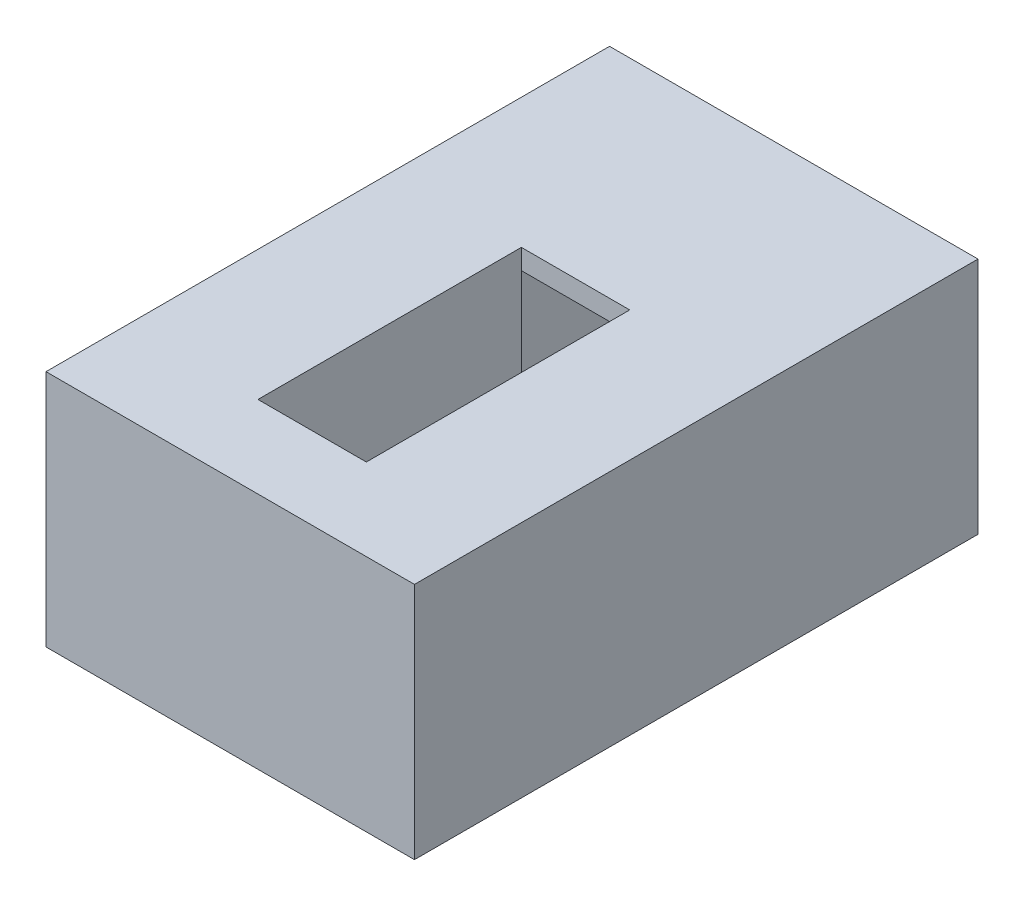
ISO-10303-21;
HEADER;
FILE_DESCRIPTION(('STEP AP214'),'2;1');
FILE_NAME('part.step','',(''),(''),'','','');
FILE_SCHEMA(('AUTOMOTIVE_DESIGN { 1 0 10303 214 1 1 1 1 }'));
ENDSEC;
DATA;
#1=APPLICATION_CONTEXT('core data for automotive mechanical design processes');
#2=APPLICATION_PROTOCOL_DEFINITION('international standard','automotive_design',2000,#1);
#3=PRODUCT_CONTEXT('',#1,'mechanical');
#4=PRODUCT('Part','Part','',(#3));
#5=PRODUCT_RELATED_PRODUCT_CATEGORY('part','',(#4));
#6=PRODUCT_DEFINITION_FORMATION('','',#4);
#7=PRODUCT_DEFINITION_CONTEXT('part definition',#1,'design');
#8=PRODUCT_DEFINITION('design','',#6,#7);
#9=PRODUCT_DEFINITION_SHAPE('','',#8);
#10=(LENGTH_UNIT() NAMED_UNIT(*) SI_UNIT(.MILLI.,.METRE.));
#11=(NAMED_UNIT(*) PLANE_ANGLE_UNIT() SI_UNIT($,.RADIAN.));
#12=(NAMED_UNIT(*) SI_UNIT($,.STERADIAN.) SOLID_ANGLE_UNIT());
#13=UNCERTAINTY_MEASURE_WITH_UNIT(LENGTH_MEASURE(1.E-05),#10,'distance_accuracy_value','');
#14=(GEOMETRIC_REPRESENTATION_CONTEXT(3) GLOBAL_UNCERTAINTY_ASSIGNED_CONTEXT((#13)) GLOBAL_UNIT_ASSIGNED_CONTEXT((#10,
#11,#12)) REPRESENTATION_CONTEXT('',''));
#15=CARTESIAN_POINT('',(0.,0.,0.));
#16=DIRECTION('',(0.,0.,1.));
#17=DIRECTION('',(1.,0.,0.));
#18=AXIS2_PLACEMENT_3D('',#15,#16,#17);
#19=CARTESIAN_POINT('',(1700.,1100.,2600.));
#20=DIRECTION('',(0.,-1.,0.));
#21=DIRECTION('',(0.,0.,-1.));
#22=AXIS2_PLACEMENT_3D('',#19,#20,#21);
#23=PLANE('',#22);
#24=DIRECTION('',(0.,0.,1.));
#25=VECTOR('',#24,1.);
#26=CARTESIAN_POINT('',(-1700.,1100.,2600.));
#27=LINE('',#26,#25);
#28=CARTESIAN_POINT('',(-1700.,1100.,-2600.));
#29=VERTEX_POINT('',#28);
#30=CARTESIAN_POINT('',(-1700.,1100.,2600.));
#31=VERTEX_POINT('',#30);
#32=EDGE_CURVE('E260',#29,#31,#27,.T.);
#33=ORIENTED_EDGE('',*,*,#32,.T.);
#34=DIRECTION('',(-1.,0.,0.));
#35=VECTOR('',#34,1.);
#36=CARTESIAN_POINT('',(1700.,1100.,2600.));
#37=LINE('',#36,#35);
#38=CARTESIAN_POINT('',(1700.,1100.,2600.));
#39=VERTEX_POINT('',#38);
#40=EDGE_CURVE('E268',#39,#31,#37,.T.);
#41=ORIENTED_EDGE('',*,*,#40,.F.);
#42=DIRECTION('',(0.,0.,1.));
#43=VECTOR('',#42,1.);
#44=CARTESIAN_POINT('',(1700.,1100.,2600.));
#45=LINE('',#44,#43);
#46=CARTESIAN_POINT('',(1700.,1100.,-2600.));
#47=VERTEX_POINT('',#46);
#48=EDGE_CURVE('E89',#47,#39,#45,.T.);
#49=ORIENTED_EDGE('',*,*,#48,.F.);
#50=DIRECTION('',(-1.,0.,0.));
#51=VECTOR('',#50,1.);
#52=CARTESIAN_POINT('',(1700.,1100.,-2600.));
#53=LINE('',#52,#51);
#54=EDGE_CURVE('E44',#47,#29,#53,.T.);
#55=ORIENTED_EDGE('',*,*,#54,.T.);
#56=EDGE_LOOP('',(#33,#41,#49,#55));
#57=FACE_BOUND('',#56,.T.);
#58=DIRECTION('',(0.,0.,1.));
#59=VECTOR('',#58,1.);
#60=CARTESIAN_POINT('',(-500.,1100.,1844.13253720411));
#61=LINE('',#60,#59);
#62=CARTESIAN_POINT('',(-500.,1100.,-586.486557773201));
#63=VERTEX_POINT('',#62);
#64=CARTESIAN_POINT('',(-500.,1100.,1844.13253720411));
#65=VERTEX_POINT('',#64);
#66=EDGE_CURVE('E208',#63,#65,#61,.T.);
#67=ORIENTED_EDGE('',*,*,#66,.F.);
#68=DIRECTION('',(1.,0.,0.));
#69=VECTOR('',#68,1.);
#70=CARTESIAN_POINT('',(-500.,1100.,-586.486557773201));
#71=LINE('',#70,#69);
#72=CARTESIAN_POINT('',(500.,1100.,-586.486557773201));
#73=VERTEX_POINT('',#72);
#74=EDGE_CURVE('E239',#63,#73,#71,.T.);
#75=ORIENTED_EDGE('',*,*,#74,.T.);
#76=DIRECTION('',(0.,0.,1.));
#77=VECTOR('',#76,1.);
#78=CARTESIAN_POINT('',(500.,1100.,1844.13253720411));
#79=LINE('',#78,#77);
#80=CARTESIAN_POINT('',(500.,1100.,1844.13253720411));
#81=VERTEX_POINT('',#80);
#82=EDGE_CURVE('E226',#73,#81,#79,.T.);
#83=ORIENTED_EDGE('',*,*,#82,.T.);
#84=DIRECTION('',(1.,0.,0.));
#85=VECTOR('',#84,1.);
#86=CARTESIAN_POINT('',(-500.,1100.,1844.13253720411));
#87=LINE('',#86,#85);
#88=EDGE_CURVE('E237',#65,#81,#87,.T.);
#89=ORIENTED_EDGE('',*,*,#88,.F.);
#90=EDGE_LOOP('',(#67,#75,#83,#89));
#91=FACE_BOUND('',#90,.T.);
#92=ADVANCED_FACE('F36',(#57,#91),#23,.F.);
#93=CARTESIAN_POINT('',(1700.,1100.,-2600.));
#94=DIRECTION('',(0.,0.,1.));
#95=DIRECTION('',(0.,-1.,0.));
#96=AXIS2_PLACEMENT_3D('',#93,#94,#95);
#97=PLANE('',#96);
#98=DIRECTION('',(0.,1.,0.));
#99=VECTOR('',#98,1.);
#100=CARTESIAN_POINT('',(-1700.,1100.,-2600.));
#101=LINE('',#100,#99);
#102=CARTESIAN_POINT('',(-1700.,-1100.,-2600.));
#103=VERTEX_POINT('',#102);
#104=EDGE_CURVE('E234',#103,#29,#101,.T.);
#105=ORIENTED_EDGE('',*,*,#104,.T.);
#106=ORIENTED_EDGE('',*,*,#54,.F.);
#107=DIRECTION('',(0.,1.,0.));
#108=VECTOR('',#107,1.);
#109=CARTESIAN_POINT('',(1700.,1100.,-2600.));
#110=LINE('',#109,#108);
#111=CARTESIAN_POINT('',(1700.,-1100.,-2600.));
#112=VERTEX_POINT('',#111);
#113=EDGE_CURVE('E251',#112,#47,#110,.T.);
#114=ORIENTED_EDGE('',*,*,#113,.F.);
#115=DIRECTION('',(-1.,0.,0.));
#116=VECTOR('',#115,1.);
#117=CARTESIAN_POINT('',(1700.,-1100.,-2600.));
#118=LINE('',#117,#116);
#119=EDGE_CURVE('E257',#112,#103,#118,.T.);
#120=ORIENTED_EDGE('',*,*,#119,.T.);
#121=EDGE_LOOP('',(#105,#106,#114,#120));
#122=FACE_BOUND('',#121,.T.);
#123=ADVANCED_FACE('F38',(#122),#97,.F.);
#124=CARTESIAN_POINT('',(1700.,1100.,2600.));
#125=DIRECTION('',(0.,0.,-1.));
#126=DIRECTION('',(0.,1.,0.));
#127=AXIS2_PLACEMENT_3D('',#124,#125,#126);
#128=PLANE('',#127);
#129=DIRECTION('',(0.,-1.,0.));
#130=VECTOR('',#129,1.);
#131=CARTESIAN_POINT('',(-1700.,1100.,2600.));
#132=LINE('',#131,#130);
#133=CARTESIAN_POINT('',(-1700.,-1100.,2600.));
#134=VERTEX_POINT('',#133);
#135=EDGE_CURVE('E262',#31,#134,#132,.T.);
#136=ORIENTED_EDGE('',*,*,#135,.T.);
#137=DIRECTION('',(-1.,0.,0.));
#138=VECTOR('',#137,1.);
#139=CARTESIAN_POINT('',(1700.,-1100.,2600.));
#140=LINE('',#139,#138);
#141=CARTESIAN_POINT('',(1700.,-1100.,2600.));
#142=VERTEX_POINT('',#141);
#143=EDGE_CURVE('E266',#142,#134,#140,.T.);
#144=ORIENTED_EDGE('',*,*,#143,.F.);
#145=DIRECTION('',(0.,-1.,0.));
#146=VECTOR('',#145,1.);
#147=CARTESIAN_POINT('',(1700.,1100.,2600.));
#148=LINE('',#147,#146);
#149=EDGE_CURVE('E254',#39,#142,#148,.T.);
#150=ORIENTED_EDGE('',*,*,#149,.F.);
#151=ORIENTED_EDGE('',*,*,#40,.T.);
#152=EDGE_LOOP('',(#136,#144,#150,#151));
#153=FACE_BOUND('',#152,.T.);
#154=ADVANCED_FACE('F280',(#153),#128,.F.);
#155=CARTESIAN_POINT('',(1700.,-1100.,2600.));
#156=DIRECTION('',(0.,1.,0.));
#157=DIRECTION('',(0.,0.,1.));
#158=AXIS2_PLACEMENT_3D('',#155,#156,#157);
#159=PLANE('',#158);
#160=DIRECTION('',(0.,0.,-1.));
#161=VECTOR('',#160,1.);
#162=CARTESIAN_POINT('',(-1700.,-1100.,2600.));
#163=LINE('',#162,#161);
#164=EDGE_CURVE('E81',#134,#103,#163,.T.);
#165=ORIENTED_EDGE('',*,*,#164,.T.);
#166=ORIENTED_EDGE('',*,*,#119,.F.);
#167=DIRECTION('',(0.,0.,-1.));
#168=VECTOR('',#167,1.);
#169=CARTESIAN_POINT('',(1700.,-1100.,2600.));
#170=LINE('',#169,#168);
#171=EDGE_CURVE('E60',#142,#112,#170,.T.);
#172=ORIENTED_EDGE('',*,*,#171,.F.);
#173=ORIENTED_EDGE('',*,*,#143,.T.);
#174=EDGE_LOOP('',(#165,#166,#172,#173));
#175=FACE_BOUND('',#174,.T.);
#176=ADVANCED_FACE('F282',(#175),#159,.F.);
#177=CARTESIAN_POINT('',(1700.,0.,0.));
#178=DIRECTION('',(1.,0.,0.));
#179=DIRECTION('',(0.,0.,-1.));
#180=AXIS2_PLACEMENT_3D('',#177,#178,#179);
#181=PLANE('',#180);
#182=ORIENTED_EDGE('',*,*,#113,.T.);
#183=ORIENTED_EDGE('',*,*,#48,.T.);
#184=ORIENTED_EDGE('',*,*,#149,.T.);
#185=ORIENTED_EDGE('',*,*,#171,.T.);
#186=EDGE_LOOP('',(#182,#183,#184,#185));
#187=FACE_BOUND('',#186,.T.);
#188=ADVANCED_FACE('F283',(#187),#181,.T.);
#189=CARTESIAN_POINT('',(-1700.,0.,0.));
#190=DIRECTION('',(1.,0.,0.));
#191=DIRECTION('',(0.,0.,-1.));
#192=AXIS2_PLACEMENT_3D('',#189,#190,#191);
#193=PLANE('',#192);
#194=ORIENTED_EDGE('',*,*,#104,.F.);
#195=ORIENTED_EDGE('',*,*,#164,.F.);
#196=ORIENTED_EDGE('',*,*,#135,.F.);
#197=ORIENTED_EDGE('',*,*,#32,.F.);
#198=EDGE_LOOP('',(#194,#195,#196,#197));
#199=FACE_BOUND('',#198,.T.);
#200=ADVANCED_FACE('F276',(#199),#193,.F.);
#201=CARTESIAN_POINT('',(-500.,930.267244324167,2363.5134422268));
#202=DIRECTION('',(0.,0.,1.));
#203=DIRECTION('',(0.,-1.,0.));
#204=AXIS2_PLACEMENT_3D('',#201,#202,#203);
#205=PLANE('',#204);
#206=DIRECTION('',(0.,-1.,0.));
#207=VECTOR('',#206,1.);
#208=CARTESIAN_POINT('',(500.,930.267244324167,2363.5134422268));
#209=LINE('',#208,#207);
#210=CARTESIAN_POINT('',(500.,930.267244324167,2363.5134422268));
#211=VERTEX_POINT('',#210);
#212=CARTESIAN_POINT('',(500.,-219.732755675832,2363.5134422268));
#213=VERTEX_POINT('',#212);
#214=EDGE_CURVE('E197',#211,#213,#209,.T.);
#215=ORIENTED_EDGE('',*,*,#214,.T.);
#216=DIRECTION('',(1.,0.,0.));
#217=VECTOR('',#216,1.);
#218=CARTESIAN_POINT('',(-500.,-219.732755675832,2363.5134422268));
#219=LINE('',#218,#217);
#220=CARTESIAN_POINT('',(-500.,-219.732755675832,2363.5134422268));
#221=VERTEX_POINT('',#220);
#222=EDGE_CURVE('E217',#221,#213,#219,.T.);
#223=ORIENTED_EDGE('',*,*,#222,.F.);
#224=DIRECTION('',(0.,-1.,0.));
#225=VECTOR('',#224,1.);
#226=CARTESIAN_POINT('',(-500.,930.267244324167,2363.5134422268));
#227=LINE('',#226,#225);
#228=CARTESIAN_POINT('',(-500.,930.267244324167,2363.5134422268));
#229=VERTEX_POINT('',#228);
#230=EDGE_CURVE('E198',#229,#221,#227,.T.);
#231=ORIENTED_EDGE('',*,*,#230,.F.);
#232=DIRECTION('',(1.,0.,0.));
#233=VECTOR('',#232,1.);
#234=CARTESIAN_POINT('',(-500.,930.267244324167,2363.5134422268));
#235=LINE('',#234,#233);
#236=EDGE_CURVE('E232',#229,#211,#235,.T.);
#237=ORIENTED_EDGE('',*,*,#236,.T.);
#238=EDGE_LOOP('',(#215,#223,#231,#237));
#239=FACE_BOUND('',#238,.T.);
#240=ADVANCED_FACE('F290',(#239),#205,.F.);
#241=CARTESIAN_POINT('',(-500.,930.267244324168,1844.13253720411));
#242=DIRECTION('',(0.,1.,0.));
#243=DIRECTION('',(0.,0.,1.));
#244=AXIS2_PLACEMENT_3D('',#241,#242,#243);
#245=PLANE('',#244);
#246=DIRECTION('',(0.,0.,1.));
#247=VECTOR('',#246,1.);
#248=CARTESIAN_POINT('',(500.,930.267244324168,1844.13253720411));
#249=LINE('',#248,#247);
#250=CARTESIAN_POINT('',(500.,930.267244324168,1844.13253720411));
#251=VERTEX_POINT('',#250);
#252=EDGE_CURVE('E202',#251,#211,#249,.T.);
#253=ORIENTED_EDGE('',*,*,#252,.T.);
#254=ORIENTED_EDGE('',*,*,#236,.F.);
#255=DIRECTION('',(0.,0.,1.));
#256=VECTOR('',#255,1.);
#257=CARTESIAN_POINT('',(-500.,930.267244324168,1844.13253720411));
#258=LINE('',#257,#256);
#259=CARTESIAN_POINT('',(-500.,930.267244324168,1844.13253720411));
#260=VERTEX_POINT('',#259);
#261=EDGE_CURVE('E214',#260,#229,#258,.T.);
#262=ORIENTED_EDGE('',*,*,#261,.F.);
#263=DIRECTION('',(1.,0.,0.));
#264=VECTOR('',#263,1.);
#265=CARTESIAN_POINT('',(-500.,930.267244324168,1844.13253720411));
#266=LINE('',#265,#264);
#267=EDGE_CURVE('E235',#260,#251,#266,.T.);
#268=ORIENTED_EDGE('',*,*,#267,.T.);
#269=EDGE_LOOP('',(#253,#254,#262,#268));
#270=FACE_BOUND('',#269,.T.);
#271=ADVANCED_FACE('F331',(#270),#245,.F.);
#272=CARTESIAN_POINT('',(-500.,930.267244324168,1844.13253720411));
#273=DIRECTION('',(0.,0.,1.));
#274=DIRECTION('',(1.,0.,0.));
#275=AXIS2_PLACEMENT_3D('',#272,#273,#274);
#276=PLANE('',#275);
#277=DIRECTION('',(0.,-1.,0.));
#278=VECTOR('',#277,1.);
#279=CARTESIAN_POINT('',(500.,930.267244324168,1844.13253720411));
#280=LINE('',#279,#278);
#281=EDGE_CURVE('E51',#81,#251,#280,.T.);
#282=ORIENTED_EDGE('',*,*,#281,.T.);
#283=ORIENTED_EDGE('',*,*,#267,.F.);
#284=DIRECTION('',(0.,-1.,0.));
#285=VECTOR('',#284,1.);
#286=CARTESIAN_POINT('',(-500.,930.267244324168,1844.13253720411));
#287=LINE('',#286,#285);
#288=EDGE_CURVE('E211',#65,#260,#287,.T.);
#289=ORIENTED_EDGE('',*,*,#288,.F.);
#290=ORIENTED_EDGE('',*,*,#88,.T.);
#291=EDGE_LOOP('',(#282,#283,#289,#290));
#292=FACE_BOUND('',#291,.T.);
#293=ADVANCED_FACE('F340',(#292),#276,.F.);
#294=CARTESIAN_POINT('',(-500.,1100.,-586.486557773201));
#295=DIRECTION('',(0.,0.,-1.));
#296=DIRECTION('',(0.,1.,0.));
#297=AXIS2_PLACEMENT_3D('',#294,#295,#296);
#298=PLANE('',#297);
#299=DIRECTION('',(0.,1.,0.));
#300=VECTOR('',#299,1.);
#301=CARTESIAN_POINT('',(500.,1100.,-586.486557773201));
#302=LINE('',#301,#300);
#303=CARTESIAN_POINT('',(500.,914.368462562869,-586.486557773201));
#304=VERTEX_POINT('',#303);
#305=EDGE_CURVE('E223',#304,#73,#302,.T.);
#306=ORIENTED_EDGE('',*,*,#305,.T.);
#307=ORIENTED_EDGE('',*,*,#74,.F.);
#308=DIRECTION('',(0.,1.,0.));
#309=VECTOR('',#308,1.);
#310=CARTESIAN_POINT('',(-500.,1100.,-586.486557773201));
#311=LINE('',#310,#309);
#312=CARTESIAN_POINT('',(-500.,914.368462562869,-586.4865577732));
#313=VERTEX_POINT('',#312);
#314=EDGE_CURVE('E205',#313,#63,#311,.T.);
#315=ORIENTED_EDGE('',*,*,#314,.F.);
#316=DIRECTION('',(1.,0.,0.));
#317=VECTOR('',#316,1.);
#318=CARTESIAN_POINT('',(-500.,914.368462562869,-586.486557773201));
#319=LINE('',#318,#317);
#320=EDGE_CURVE('E164',#313,#304,#319,.T.);
#321=ORIENTED_EDGE('',*,*,#320,.T.);
#322=EDGE_LOOP('',(#306,#307,#315,#321));
#323=FACE_BOUND('',#322,.T.);
#324=ADVANCED_FACE('F350',(#323),#298,.F.);
#325=CARTESIAN_POINT('',(-500.,914.36846256287,-2386.4865577732));
#326=DIRECTION('',(0.,1.,0.));
#327=DIRECTION('',(0.,0.,1.));
#328=AXIS2_PLACEMENT_3D('',#325,#326,#327);
#329=PLANE('',#328);
#330=DIRECTION('',(1.,0.,0.));
#331=VECTOR('',#330,1.);
#332=CARTESIAN_POINT('',(-500.,914.36846256287,-2386.4865577732));
#333=LINE('',#332,#331);
#334=CARTESIAN_POINT('',(-1000.,914.36846256287,-2386.4865577732));
#335=VERTEX_POINT('',#334);
#336=CARTESIAN_POINT('',(1000.,914.36846256287,-2386.4865577732));
#337=VERTEX_POINT('',#336);
#338=EDGE_CURVE('E153',#335,#337,#333,.T.);
#339=ORIENTED_EDGE('',*,*,#338,.T.);
#340=DIRECTION('',(0.,0.,1.));
#341=VECTOR('',#340,1.);
#342=CARTESIAN_POINT('',(1000.,914.36846256287,-2386.4865577732));
#343=LINE('',#342,#341);
#344=CARTESIAN_POINT('',(1000.,914.368462562869,-586.4865577732));
#345=VERTEX_POINT('',#344);
#346=EDGE_CURVE('E190',#337,#345,#343,.T.);
#347=ORIENTED_EDGE('',*,*,#346,.T.);
#348=DIRECTION('',(1.,0.,0.));
#349=VECTOR('',#348,1.);
#350=CARTESIAN_POINT('',(-1000.,914.368462562869,-586.4865577732));
#351=LINE('',#350,#349);
#352=EDGE_CURVE('E188',#304,#345,#351,.T.);
#353=ORIENTED_EDGE('',*,*,#352,.F.);
#354=ORIENTED_EDGE('',*,*,#320,.F.);
#355=CARTESIAN_POINT('',(-1000.,914.368462562869,-586.4865577732));
#356=VERTEX_POINT('',#355);
#357=EDGE_CURVE('E171',#356,#313,#351,.T.);
#358=ORIENTED_EDGE('',*,*,#357,.F.);
#359=DIRECTION('',(0.,0.,1.));
#360=VECTOR('',#359,1.);
#361=CARTESIAN_POINT('',(-1000.,914.36846256287,-2386.4865577732));
#362=LINE('',#361,#360);
#363=EDGE_CURVE('E168',#335,#356,#362,.T.);
#364=ORIENTED_EDGE('',*,*,#363,.F.);
#365=EDGE_LOOP('',(#339,#347,#353,#354,#358,#364));
#366=FACE_BOUND('',#365,.T.);
#367=ADVANCED_FACE('F169',(#366),#329,.F.);
#368=CARTESIAN_POINT('',(-500.,-780.268672554064,-2386.4865577732));
#369=DIRECTION('',(0.,0.,-1.));
#370=DIRECTION('',(-1.,0.,0.));
#371=AXIS2_PLACEMENT_3D('',#368,#369,#370);
#372=PLANE('',#371);
#373=DIRECTION('',(1.,0.,0.));
#374=VECTOR('',#373,1.);
#375=CARTESIAN_POINT('',(-500.,-780.268672554064,-2386.4865577732));
#376=LINE('',#375,#374);
#377=CARTESIAN_POINT('',(-1000.,-780.268672554064,-2386.4865577732));
#378=VERTEX_POINT('',#377);
#379=CARTESIAN_POINT('',(1000.,-780.268672554064,-2386.4865577732));
#380=VERTEX_POINT('',#379);
#381=EDGE_CURVE('E165',#378,#380,#376,.T.);
#382=ORIENTED_EDGE('',*,*,#381,.T.);
#383=DIRECTION('',(0.,1.,0.));
#384=VECTOR('',#383,1.);
#385=CARTESIAN_POINT('',(1000.,914.36846256287,-2386.4865577732));
#386=LINE('',#385,#384);
#387=EDGE_CURVE('E160',#380,#337,#386,.T.);
#388=ORIENTED_EDGE('',*,*,#387,.T.);
#389=ORIENTED_EDGE('',*,*,#338,.F.);
#390=DIRECTION('',(0.,1.,0.));
#391=VECTOR('',#390,1.);
#392=CARTESIAN_POINT('',(-1000.,914.36846256287,-2386.4865577732));
#393=LINE('',#392,#391);
#394=EDGE_CURVE('E157',#378,#335,#393,.T.);
#395=ORIENTED_EDGE('',*,*,#394,.F.);
#396=EDGE_LOOP('',(#382,#388,#389,#395));
#397=FACE_BOUND('',#396,.T.);
#398=ADVANCED_FACE('F155',(#397),#372,.F.);
#399=CARTESIAN_POINT('',(-500.,-780.268672554064,-586.486557773201));
#400=DIRECTION('',(0.,-1.,0.));
#401=DIRECTION('',(0.,0.,-1.));
#402=AXIS2_PLACEMENT_3D('',#399,#400,#401);
#403=PLANE('',#402);
#404=DIRECTION('',(1.,0.,0.));
#405=VECTOR('',#404,1.);
#406=CARTESIAN_POINT('',(-500.,-780.268672554064,-586.486557773201));
#407=LINE('',#406,#405);
#408=CARTESIAN_POINT('',(-1000.,-780.268672554064,-586.486557773201));
#409=VERTEX_POINT('',#408);
#410=CARTESIAN_POINT('',(1000.,-780.268672554064,-586.486557773201));
#411=VERTEX_POINT('',#410);
#412=EDGE_CURVE('E245',#409,#411,#407,.T.);
#413=ORIENTED_EDGE('',*,*,#412,.T.);
#414=DIRECTION('',(0.,0.,-1.));
#415=VECTOR('',#414,1.);
#416=CARTESIAN_POINT('',(1000.,-780.268672554064,-2386.4865577732));
#417=LINE('',#416,#415);
#418=EDGE_CURVE('E180',#411,#380,#417,.T.);
#419=ORIENTED_EDGE('',*,*,#418,.T.);
#420=ORIENTED_EDGE('',*,*,#381,.F.);
#421=DIRECTION('',(0.,0.,-1.));
#422=VECTOR('',#421,1.);
#423=CARTESIAN_POINT('',(-1000.,-780.268672554064,-2386.4865577732));
#424=LINE('',#423,#422);
#425=EDGE_CURVE('E179',#409,#378,#424,.T.);
#426=ORIENTED_EDGE('',*,*,#425,.F.);
#427=EDGE_LOOP('',(#413,#419,#420,#426));
#428=FACE_BOUND('',#427,.T.);
#429=ADVANCED_FACE('F379',(#428),#403,.F.);
#430=CARTESIAN_POINT('',(-500.,-219.732755675832,-586.4865577732));
#431=DIRECTION('',(0.,0.,1.));
#432=DIRECTION('',(0.,-1.,0.));
#433=AXIS2_PLACEMENT_3D('',#430,#431,#432);
#434=PLANE('',#433);
#435=DIRECTION('',(1.,0.,0.));
#436=VECTOR('',#435,1.);
#437=CARTESIAN_POINT('',(-500.,-219.732755675832,-586.4865577732));
#438=LINE('',#437,#436);
#439=CARTESIAN_POINT('',(-500.,-219.732755675832,-586.486557773201));
#440=VERTEX_POINT('',#439);
#441=CARTESIAN_POINT('',(500.,-219.732755675832,-586.486557773201));
#442=VERTEX_POINT('',#441);
#443=EDGE_CURVE('E247',#440,#442,#438,.T.);
#444=ORIENTED_EDGE('',*,*,#443,.T.);
#445=DIRECTION('',(0.,-1.,0.));
#446=VECTOR('',#445,1.);
#447=CARTESIAN_POINT('',(500.,0.,-586.486557773201));
#448=LINE('',#447,#446);
#449=EDGE_CURVE('E11',#304,#442,#448,.T.);
#450=ORIENTED_EDGE('',*,*,#449,.F.);
#451=ORIENTED_EDGE('',*,*,#352,.T.);
#452=DIRECTION('',(0.,-1.,0.));
#453=VECTOR('',#452,1.);
#454=CARTESIAN_POINT('',(1000.,914.368462562869,-586.4865577732));
#455=LINE('',#454,#453);
#456=EDGE_CURVE('E183',#345,#411,#455,.T.);
#457=ORIENTED_EDGE('',*,*,#456,.T.);
#458=ORIENTED_EDGE('',*,*,#412,.F.);
#459=DIRECTION('',(0.,-1.,0.));
#460=VECTOR('',#459,1.);
#461=CARTESIAN_POINT('',(-1000.,914.368462562869,-586.4865577732));
#462=LINE('',#461,#460);
#463=EDGE_CURVE('E175',#356,#409,#462,.T.);
#464=ORIENTED_EDGE('',*,*,#463,.F.);
#465=ORIENTED_EDGE('',*,*,#357,.T.);
#466=DIRECTION('',(0.,-1.,0.));
#467=VECTOR('',#466,1.);
#468=CARTESIAN_POINT('',(-500.,0.,-586.486557773201));
#469=LINE('',#468,#467);
#470=EDGE_CURVE('E195',#313,#440,#469,.T.);
#471=ORIENTED_EDGE('',*,*,#470,.T.);
#472=EDGE_LOOP('',(#444,#450,#451,#457,#458,#464,#465,#471));
#473=FACE_BOUND('',#472,.T.);
#474=ADVANCED_FACE('F389',(#473),#434,.F.);
#475=CARTESIAN_POINT('',(-500.,-219.732755675832,2363.5134422268));
#476=DIRECTION('',(0.,-1.,0.));
#477=DIRECTION('',(0.,0.,-1.));
#478=AXIS2_PLACEMENT_3D('',#475,#476,#477);
#479=PLANE('',#478);
#480=DIRECTION('',(0.,0.,-1.));
#481=VECTOR('',#480,1.);
#482=CARTESIAN_POINT('',(500.,-219.732755675832,2363.5134422268));
#483=LINE('',#482,#481);
#484=EDGE_CURVE('E220',#213,#442,#483,.T.);
#485=ORIENTED_EDGE('',*,*,#484,.T.);
#486=ORIENTED_EDGE('',*,*,#443,.F.);
#487=DIRECTION('',(0.,0.,-1.));
#488=VECTOR('',#487,1.);
#489=CARTESIAN_POINT('',(-500.,-219.732755675832,2363.5134422268));
#490=LINE('',#489,#488);
#491=EDGE_CURVE('E201',#221,#440,#490,.T.);
#492=ORIENTED_EDGE('',*,*,#491,.F.);
#493=ORIENTED_EDGE('',*,*,#222,.T.);
#494=EDGE_LOOP('',(#485,#486,#492,#493));
#495=FACE_BOUND('',#494,.T.);
#496=ADVANCED_FACE('F400',(#495),#479,.F.);
#497=CARTESIAN_POINT('',(-500.,0.,0.));
#498=DIRECTION('',(1.,0.,0.));
#499=DIRECTION('',(0.,0.,-1.));
#500=AXIS2_PLACEMENT_3D('',#497,#498,#499);
#501=PLANE('',#500);
#502=ORIENTED_EDGE('',*,*,#470,.F.);
#503=ORIENTED_EDGE('',*,*,#314,.T.);
#504=ORIENTED_EDGE('',*,*,#66,.T.);
#505=ORIENTED_EDGE('',*,*,#288,.T.);
#506=ORIENTED_EDGE('',*,*,#261,.T.);
#507=ORIENTED_EDGE('',*,*,#230,.T.);
#508=ORIENTED_EDGE('',*,*,#491,.T.);
#509=EDGE_LOOP('',(#502,#503,#504,#505,#506,#507,#508));
#510=FACE_BOUND('',#509,.T.);
#511=ADVANCED_FACE('F412',(#510),#501,.T.);
#512=CARTESIAN_POINT('',(500.,0.,0.));
#513=DIRECTION('',(1.,0.,0.));
#514=DIRECTION('',(0.,0.,-1.));
#515=AXIS2_PLACEMENT_3D('',#512,#513,#514);
#516=PLANE('',#515);
#517=ORIENTED_EDGE('',*,*,#305,.F.);
#518=ORIENTED_EDGE('',*,*,#449,.T.);
#519=ORIENTED_EDGE('',*,*,#484,.F.);
#520=ORIENTED_EDGE('',*,*,#214,.F.);
#521=ORIENTED_EDGE('',*,*,#252,.F.);
#522=ORIENTED_EDGE('',*,*,#281,.F.);
#523=ORIENTED_EDGE('',*,*,#82,.F.);
#524=EDGE_LOOP('',(#517,#518,#519,#520,#521,#522,#523));
#525=FACE_BOUND('',#524,.T.);
#526=ADVANCED_FACE('F422',(#525),#516,.F.);
#527=CARTESIAN_POINT('',(1000.,0.,0.));
#528=DIRECTION('',(-1.,0.,0.));
#529=DIRECTION('',(0.,0.,1.));
#530=AXIS2_PLACEMENT_3D('',#527,#528,#529);
#531=PLANE('',#530);
#532=ORIENTED_EDGE('',*,*,#387,.F.);
#533=ORIENTED_EDGE('',*,*,#418,.F.);
#534=ORIENTED_EDGE('',*,*,#456,.F.);
#535=ORIENTED_EDGE('',*,*,#346,.F.);
#536=EDGE_LOOP('',(#532,#533,#534,#535));
#537=FACE_BOUND('',#536,.T.);
#538=ADVANCED_FACE('F431',(#537),#531,.T.);
#539=CARTESIAN_POINT('',(-1000.,0.,0.));
#540=DIRECTION('',(-1.,0.,0.));
#541=DIRECTION('',(0.,0.,1.));
#542=AXIS2_PLACEMENT_3D('',#539,#540,#541);
#543=PLANE('',#542);
#544=ORIENTED_EDGE('',*,*,#394,.T.);
#545=ORIENTED_EDGE('',*,*,#363,.T.);
#546=ORIENTED_EDGE('',*,*,#463,.T.);
#547=ORIENTED_EDGE('',*,*,#425,.T.);
#548=EDGE_LOOP('',(#544,#545,#546,#547));
#549=FACE_BOUND('',#548,.T.);
#550=ADVANCED_FACE('F177',(#549),#543,.F.);
#551=CLOSED_SHELL('',(#92,#123,#154,#176,#188,#200,#240,#271,#293,#324,#367,#398,#429,#474,#496,
#511,#526,#538,#550));
#552=MANIFOLD_SOLID_BREP('B2',#551);
#553=ADVANCED_BREP_SHAPE_REPRESENTATION('',(#18,#552),#14);
#554=SHAPE_DEFINITION_REPRESENTATION(#9,#553);
ENDSEC;
END-ISO-10303-21;
